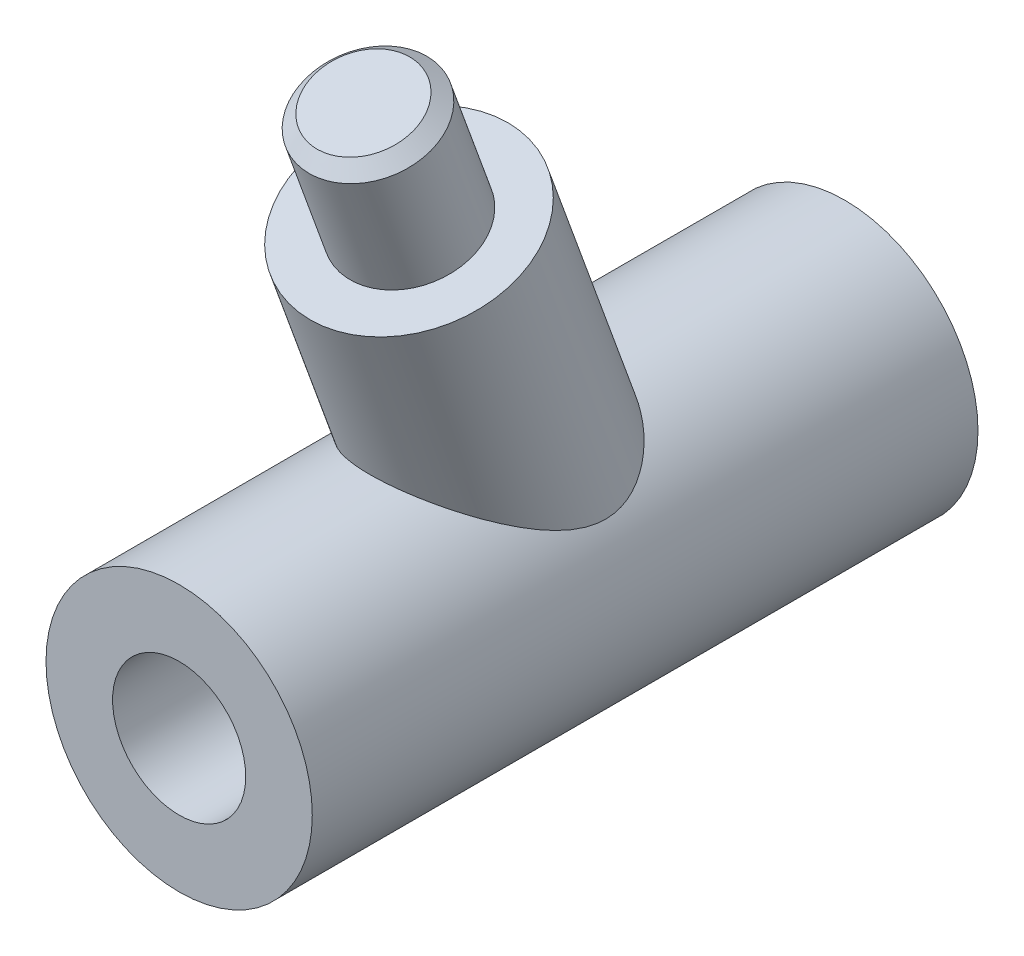
ISO-10303-21;
HEADER;
FILE_DESCRIPTION(('STEP AP214'),'2;1');
FILE_NAME('part.step','',(''),(''),'','','');
FILE_SCHEMA(('AUTOMOTIVE_DESIGN { 1 0 10303 214 1 1 1 1 }'));
ENDSEC;
DATA;
#1=APPLICATION_CONTEXT('core data for automotive mechanical design processes');
#2=APPLICATION_PROTOCOL_DEFINITION('international standard','automotive_design',2000,#1);
#3=PRODUCT_CONTEXT('',#1,'mechanical');
#4=PRODUCT('Part','Part','',(#3));
#5=PRODUCT_RELATED_PRODUCT_CATEGORY('part','',(#4));
#6=PRODUCT_DEFINITION_FORMATION('','',#4);
#7=PRODUCT_DEFINITION_CONTEXT('part definition',#1,'design');
#8=PRODUCT_DEFINITION('design','',#6,#7);
#9=PRODUCT_DEFINITION_SHAPE('','',#8);
#10=(LENGTH_UNIT() NAMED_UNIT(*) SI_UNIT(.MILLI.,.METRE.));
#11=(NAMED_UNIT(*) PLANE_ANGLE_UNIT() SI_UNIT($,.RADIAN.));
#12=(NAMED_UNIT(*) SI_UNIT($,.STERADIAN.) SOLID_ANGLE_UNIT());
#13=UNCERTAINTY_MEASURE_WITH_UNIT(LENGTH_MEASURE(1.E-05),#10,'distance_accuracy_value','');
#14=(GEOMETRIC_REPRESENTATION_CONTEXT(3) GLOBAL_UNCERTAINTY_ASSIGNED_CONTEXT((#13)) GLOBAL_UNIT_ASSIGNED_CONTEXT((#10,
#11,#12)) REPRESENTATION_CONTEXT('',''));
#15=CARTESIAN_POINT('',(0.,0.,0.));
#16=DIRECTION('',(0.,0.,1.));
#17=DIRECTION('',(1.,0.,0.));
#18=AXIS2_PLACEMENT_3D('',#15,#16,#17);
#19=CARTESIAN_POINT('',(0.,0.,50.));
#20=DIRECTION('',(0.,0.,-1.));
#21=DIRECTION('',(-1.,0.,0.));
#22=AXIS2_PLACEMENT_3D('',#19,#20,#21);
#23=CYLINDRICAL_SURFACE('',#22,10.);
#24=CARTESIAN_POINT('',(0.,0.,50.));
#25=DIRECTION('',(0.,0.,1.));
#26=DIRECTION('',(1.,0.,0.));
#27=AXIS2_PLACEMENT_3D('',#24,#25,#26);
#28=CIRCLE('',#27,10.);
#29=CARTESIAN_POINT('',(10.,0.,50.));
#30=VERTEX_POINT('',#29);
#31=EDGE_CURVE('E54',#30,#30,#28,.T.);
#32=ORIENTED_EDGE('',*,*,#31,.F.);
#33=EDGE_LOOP('',(#32));
#34=FACE_BOUND('',#33,.T.);
#35=CARTESIAN_POINT('',(0.,0.,0.));
#36=DIRECTION('',(0.,0.,1.));
#37=DIRECTION('',(1.,0.,0.));
#38=AXIS2_PLACEMENT_3D('',#35,#36,#37);
#39=CIRCLE('',#38,10.);
#40=CARTESIAN_POINT('',(10.,0.,0.));
#41=VERTEX_POINT('',#40);
#42=EDGE_CURVE('E55',#41,#41,#39,.T.);
#43=ORIENTED_EDGE('',*,*,#42,.T.);
#44=EDGE_LOOP('',(#43));
#45=FACE_BOUND('',#44,.T.);
#46=CARTESIAN_POINT('',(0.,10.,35.6864090878839));
#47=CARTESIAN_POINT('',(0.168759826717268,9.99999875421944,35.6864071390971));
#48=CARTESIAN_POINT('',(0.337540186331122,9.99571534603131,35.6790801913484));
#49=CARTESIAN_POINT('',(0.673429271317358,9.97871683016679,35.6499773659063));
#50=CARTESIAN_POINT('',(0.840537705424812,9.96600027845441,35.6281990136489));
#51=CARTESIAN_POINT('',(1.17166662149929,9.93251810287568,35.5707703917559));
#52=CARTESIAN_POINT('',(1.33568430974946,9.91174553177322,35.5351081490244));
#53=CARTESIAN_POINT('',(1.65926711268916,9.86273969532586,35.4507967501226));
#54=CARTESIAN_POINT('',(1.81882990671734,9.83450261885577,35.4021409597542));
#55=CARTESIAN_POINT('',(2.13082584689765,9.7716245379265,35.2934991203973));
#56=CARTESIAN_POINT('',(2.28331535629902,9.73705222806921,35.2336344732561));
#57=CARTESIAN_POINT('',(2.58227104254561,9.66207324249375,35.1033733080117));
#58=CARTESIAN_POINT('',(2.7287343577385,9.6216638350822,35.0329718582477));
#59=CARTESIAN_POINT('',(3.15830028848461,9.49286074866993,34.8076900269744));
#60=CARTESIAN_POINT('',(3.43182257981848,9.39684103181847,34.6386443834426));
#61=CARTESIAN_POINT('',(3.89426981710559,9.21315897798917,34.3116900121693));
#62=CARTESIAN_POINT('',(4.08854874311518,9.12832329638297,34.1595464177315));
#63=CARTESIAN_POINT('',(4.46124856337198,8.95207951944924,33.8401805017747));
#64=CARTESIAN_POINT('',(4.63966135801971,8.86066810982101,33.6729505654901));
#65=CARTESIAN_POINT('',(4.98163604504653,8.67303192188411,33.3253075815331));
#66=CARTESIAN_POINT('',(5.14514754074537,8.57679240066488,33.1448532687555));
#67=CARTESIAN_POINT('',(5.45738047466906,8.38158015350033,32.7730634766211));
#68=CARTESIAN_POINT('',(5.60610324832201,8.28260767537533,32.5817289822066));
#69=CARTESIAN_POINT('',(5.94390451266904,8.04533590512657,32.1141375656525));
#70=CARTESIAN_POINT('',(6.12655422925433,7.90652687007714,31.8334799076696));
#71=CARTESIAN_POINT('',(6.46639966562251,7.63108917113799,31.2559708880049));
#72=CARTESIAN_POINT('',(6.62357869507479,7.49446198939163,30.9591090770617));
#73=CARTESIAN_POINT('',(6.91287426563268,7.2284603292765,30.3508708600595));
#74=CARTESIAN_POINT('',(7.04503053269601,7.09907458847934,30.0395184551737));
#75=CARTESIAN_POINT('',(7.22432157465985,6.91495017024337,29.5617772822818));
#76=CARTESIAN_POINT('',(7.280914987281,6.85524953998169,29.4007908228604));
#77=CARTESIAN_POINT('',(7.38762263676795,6.74011746418009,29.0751965050798));
#78=CARTESIAN_POINT('',(7.43773803859008,6.68468525176718,28.9105893040951));
#79=CARTESIAN_POINT('',(7.53168991572059,6.57865623097756,28.5760327665592));
#80=CARTESIAN_POINT('',(7.57545603686061,6.52811540608183,28.4060457723594));
#81=CARTESIAN_POINT('',(7.65562457360982,6.4339131173203,28.0624946238159));
#82=CARTESIAN_POINT('',(7.6920290928939,6.39024968893844,27.8889315070627));
#83=CARTESIAN_POINT('',(7.75681859928311,6.31144724414092,27.5386737475704));
#84=CARTESIAN_POINT('',(7.78521625208069,6.27629477721856,27.3619845258514));
#85=CARTESIAN_POINT('',(7.83326715444001,6.21622202599869,27.0056772220141));
#86=CARTESIAN_POINT('',(7.85292197382103,6.19129990485371,26.8260596717009));
#87=CARTESIAN_POINT('',(7.87998708354155,6.15680078013761,26.4958253141776));
#88=CARTESIAN_POINT('',(7.8889219778084,6.14532169618626,26.3455342631491));
#89=CARTESIAN_POINT('',(7.89955763456892,6.13164501141249,26.0442869719184));
#90=CARTESIAN_POINT('',(7.90126044020698,6.12944478921107,25.8933309316488));
#91=CARTESIAN_POINT('',(7.8968777654343,6.135090637313,25.5918859402216));
#92=CARTESIAN_POINT('',(7.89080197156089,6.14292421273085,25.4413966416088));
#93=CARTESIAN_POINT('',(7.87041845049985,6.16901839709791,25.1418738430884));
#94=CARTESIAN_POINT('',(7.85611085561657,6.18727883846289,24.9928403198223));
#95=CARTESIAN_POINT('',(7.81891575650166,6.23421626869308,24.6970184365279));
#96=CARTESIAN_POINT('',(7.79600145445856,6.26292578300544,24.5502385949599));
#97=CARTESIAN_POINT('',(7.74151712673761,6.33014835968069,24.2605912534396));
#98=CARTESIAN_POINT('',(7.70994701835814,6.36866151571191,24.1177237908822));
#99=CARTESIAN_POINT('',(7.63821412461277,6.45451864803437,23.8366458800247));
#100=CARTESIAN_POINT('',(7.59803816366566,6.5018761506337,23.6984429529895));
#101=CARTESIAN_POINT('',(7.5093826199623,6.60407048750467,23.4275641988082));
#102=CARTESIAN_POINT('',(7.46090080787088,6.65890932900097,23.2948898674842));
#103=CARTESIAN_POINT('',(7.34214717537962,6.78988939092157,23.0012699179967));
#104=CARTESIAN_POINT('',(7.26950007614489,6.86783582615953,22.8420887641007));
#105=CARTESIAN_POINT('',(7.1122398176786,7.03056543539082,22.5334354350772));
#106=CARTESIAN_POINT('',(7.02762305972012,7.11535066218785,22.3839661996729));
#107=CARTESIAN_POINT('',(6.84702552341834,7.28930576256339,22.0944913848307));
#108=CARTESIAN_POINT('',(6.75103143156339,7.37848070013642,21.954497199786));
#109=CARTESIAN_POINT('',(6.54837788726454,7.5589123714027,21.6839373957007));
#110=CARTESIAN_POINT('',(6.44171911432236,7.65016897217687,21.5533711768675));
#111=CARTESIAN_POINT('',(6.21514846145864,7.83542818393242,21.2979010648342));
#112=CARTESIAN_POINT('',(6.09495064451129,7.92943662922722,21.1732553690342));
#113=CARTESIAN_POINT('',(5.84434716965742,8.11591059995631,20.9334462245162));
#114=CARTESIAN_POINT('',(5.71394153885302,8.20837612948629,20.8182827506241));
#115=CARTESIAN_POINT('',(5.44342147203671,8.39021569765755,20.5973549030536));
#116=CARTESIAN_POINT('',(5.30330864255279,8.47959024419914,20.4915889806751));
#117=CARTESIAN_POINT('',(5.01384650327767,8.65389479818482,20.2894470850873));
#118=CARTESIAN_POINT('',(4.86449686387894,8.73882464682387,20.1930714472784));
#119=CARTESIAN_POINT('',(4.52749615315887,8.91879647592465,19.9921835323946));
#120=CARTESIAN_POINT('',(4.33800355175961,9.01264120555651,19.8896719808733));
#121=CARTESIAN_POINT('',(3.94764244241388,9.19032752104317,19.6984956454274));
#122=CARTESIAN_POINT('',(3.74677257106234,9.27416790426243,19.6098325258459));
#123=CARTESIAN_POINT('',(3.33489252091246,9.43011020345129,19.4468261955555));
#124=CARTESIAN_POINT('',(3.12388210458398,9.50221184428116,19.3724833204858));
#125=CARTESIAN_POINT('',(2.6932093654705,9.63313364074987,19.2386523988533));
#126=CARTESIAN_POINT('',(2.47354793385084,9.69195516023021,19.1791628268199));
#127=CARTESIAN_POINT('',(2.04004397748889,9.79208082966772,19.0785104039531));
#128=CARTESIAN_POINT('',(1.82658626369448,9.83419393441823,19.036494528847));
#129=CARTESIAN_POINT('',(1.39513191582467,9.90461383029405,18.9664949849203));
#130=CARTESIAN_POINT('',(1.17713540514634,9.93292099625412,18.9385109351315));
#131=CARTESIAN_POINT('',(0.738506769971482,9.97512549444111,18.8968610085274));
#132=CARTESIAN_POINT('',(0.517876053612191,9.98903020491161,18.8831878003638));
#133=CARTESIAN_POINT('',(0.0757624678095885,10.002157686433,18.8702774393599));
#134=CARTESIAN_POINT('',(-0.145720348093114,10.0013813653573,18.8710393938507));
#135=CARTESIAN_POINT('',(-0.569364941561772,9.98583913360108,18.8863278574492));
#136=CARTESIAN_POINT('',(-0.771612463010394,9.97223328225625,18.8997129806084));
#137=CARTESIAN_POINT('',(-1.1737530685986,9.93293069469143,18.9385037791801));
#138=CARTESIAN_POINT('',(-1.37364630741163,9.90723475736849,18.9639086603433));
#139=CARTESIAN_POINT('',(-1.76969237361388,9.84420625181128,19.0265264868555));
#140=CARTESIAN_POINT('',(-1.96584543177106,9.80687440399048,19.0637387011802));
#141=CARTESIAN_POINT('',(-2.35315804055682,9.72121329056384,19.1496896044213));
#142=CARTESIAN_POINT('',(-2.5443174447432,9.67288370284472,19.1984286309485));
#143=CARTESIAN_POINT('',(-2.92206320582428,9.56558518800076,19.3075580669405));
#144=CARTESIAN_POINT('',(-3.1085981890296,9.50653096860588,19.368042172643));
#145=CARTESIAN_POINT('',(-3.47439702830418,9.37902366896198,19.5000455466425));
#146=CARTESIAN_POINT('',(-3.6536608853871,9.31057059002324,19.5715648134012));
#147=CARTESIAN_POINT('',(-4.00411119237793,9.16531983007489,19.7253413319072));
#148=CARTESIAN_POINT('',(-4.17529411545749,9.0885185530133,19.8076032142181));
#149=CARTESIAN_POINT('',(-4.50875289443422,8.92778871376216,19.9825652844379));
#150=CARTESIAN_POINT('',(-4.67102803594978,8.84385958130743,20.0752663077257));
#151=CARTESIAN_POINT('',(-4.99983081855791,8.66256027608942,20.2794885432887));
#152=CARTESIAN_POINT('',(-5.16548300003504,8.56465686319105,20.3919473272529));
#153=CARTESIAN_POINT('',(-5.48473684890454,8.36380488531226,20.6288684958471));
#154=CARTESIAN_POINT('',(-5.63833695258178,8.26085566846233,20.753332433449));
#155=CARTESIAN_POINT('',(-5.93282001321956,8.05197138495423,21.0143505899935));
#156=CARTESIAN_POINT('',(-6.07369872312142,7.94603533651266,21.1509088167173));
#157=CARTESIAN_POINT('',(-6.34194918458883,7.73362304765821,21.4362957809544));
#158=CARTESIAN_POINT('',(-6.46932382809657,7.62714692804212,21.5851218790767));
#159=CARTESIAN_POINT('',(-6.68579878184049,7.43750556627566,21.8644663466572));
#160=CARTESIAN_POINT('',(-6.77746662099948,7.35392552857709,21.9927181882131));
#161=CARTESIAN_POINT('',(-6.95116172256998,7.18996541603203,22.2575184940997));
#162=CARTESIAN_POINT('',(-7.03319099704885,7.10958467565161,22.3940652177985));
#163=CARTESIAN_POINT('',(-7.18694620083342,6.95411676090704,22.6753531103626));
#164=CARTESIAN_POINT('',(-7.2586899771391,6.87902053526221,22.8200794624424));
#165=CARTESIAN_POINT('',(-7.39143944552134,6.7361808183544,23.1178598826372));
#166=CARTESIAN_POINT('',(-7.45244767512152,6.66843559101688,23.2709119715997));
#167=CARTESIAN_POINT('',(-7.55297550330005,6.5541779212948,23.5560483544401));
#168=CARTESIAN_POINT('',(-7.59438382940312,6.50605100386696,23.6868207598808));
#169=CARTESIAN_POINT('',(-7.66939022804063,6.41746250997462,23.9531044134209));
#170=CARTESIAN_POINT('',(-7.70299011142704,6.37699915666042,24.0886145543912));
#171=CARTESIAN_POINT('',(-7.76219638414383,6.30479908516989,24.3635146175197));
#172=CARTESIAN_POINT('',(-7.78781028086546,6.27305417440764,24.5029007608522));
#173=CARTESIAN_POINT('',(-7.83107965478815,6.21895435900616,24.7847014137132));
#174=CARTESIAN_POINT('',(-7.8487350052263,6.19659960393275,24.9271159714402));
#175=CARTESIAN_POINT('',(-7.87624051194658,6.16160192241589,25.2137042449269));
#176=CARTESIAN_POINT('',(-7.88609987678023,6.1489475385186,25.3578756803718));
#177=CARTESIAN_POINT('',(-7.89839003626523,6.13314830033174,25.647014463668));
#178=CARTESIAN_POINT('',(-7.90082077994539,6.13000351129187,25.7919818169736));
#179=CARTESIAN_POINT('',(-7.89763630116207,6.13412870507261,26.2269449846954));
#180=CARTESIAN_POINT('',(-7.88153004335717,6.1549767883485,26.5168409358002));
#181=CARTESIAN_POINT('',(-7.83144421752635,6.21848756855762,27.0293835682188));
#182=CARTESIAN_POINT('',(-7.8019691110961,6.25559919328007,27.2532772701395));
#183=CARTESIAN_POINT('',(-7.72997973833747,6.34434386107111,27.6961483661867));
#184=CARTESIAN_POINT('',(-7.68745736850922,6.39598592716477,27.9151226139328));
#185=CARTESIAN_POINT('',(-7.5905338567081,6.51071713991951,28.3482082059446));
#186=CARTESIAN_POINT('',(-7.53608860973118,6.57384863767645,28.5622981462754));
#187=CARTESIAN_POINT('',(-7.41633473220055,6.70866001881199,28.9845899232805));
#188=CARTESIAN_POINT('',(-7.35102711417247,6.78033910525912,29.1927923066435));
#189=CARTESIAN_POINT('',(-7.16944570960004,6.97318219005577,29.7218029398887));
#190=CARTESIAN_POINT('',(-7.04550354248902,7.09903997779947,30.0382875324786));
#191=CARTESIAN_POINT('',(-6.77275450866556,7.35972015384047,30.6566763773514));
#192=CARTESIAN_POINT('',(-6.62393144563492,7.49454834681498,30.9585709661214));
#193=CARTESIAN_POINT('',(-6.30129409607894,7.76777600770264,31.5463402677351));
#194=CARTESIAN_POINT('',(-6.12751751014643,7.90616983426373,31.8322382591711));
#195=CARTESIAN_POINT('',(-5.75369401795444,8.18223632189856,32.3865132604253));
#196=CARTESIAN_POINT('',(-5.55366600989937,8.31990942836982,32.6549026684199));
#197=CARTESIAN_POINT('',(-5.2060761294037,8.53942100177106,33.0740244472533));
#198=CARTESIAN_POINT('',(-5.06705110091291,8.62279694653861,33.2310649720752));
#199=CARTESIAN_POINT('',(-4.77757955784289,8.78648928802169,33.5360433648831));
#200=CARTESIAN_POINT('',(-4.62713174073933,8.86680533424846,33.6839801912945));
#201=CARTESIAN_POINT('',(-4.31463079861706,9.02299295532508,33.9690934647034));
#202=CARTESIAN_POINT('',(-4.15259642906238,9.09887136702655,34.1062865808493));
#203=CARTESIAN_POINT('',(-3.81651466707181,9.24488147468791,34.368346428295));
#204=CARTESIAN_POINT('',(-3.64246956175052,9.31501425921198,34.4932154954261));
#205=CARTESIAN_POINT('',(-3.18683646918618,9.48314234233689,34.7907918528153));
#206=CARTESIAN_POINT('',(-2.89694909764727,9.5763200207364,34.9539878240861));
#207=CARTESIAN_POINT('',(-2.44267888050194,9.69834836638095,35.1664725457355));
#208=CARTESIAN_POINT('',(-2.28804954080809,9.73606216348595,35.231905738085));
#209=CARTESIAN_POINT('',(-1.97279308915188,9.80479810675246,35.3508703851355));
#210=CARTESIAN_POINT('',(-1.81216712167467,9.8358215222234,35.4044040974832));
#211=CARTESIAN_POINT('',(-1.51629207018075,9.88529154920519,35.4896168092495));
#212=CARTESIAN_POINT('',(-1.38188776342846,9.90500439524869,35.5235091734013));
#213=CARTESIAN_POINT('',(-1.11042485688468,9.93909744400342,35.5820632421081));
#214=CARTESIAN_POINT('',(-0.973366722030315,9.95347857206723,35.6067265484301));
#215=CARTESIAN_POINT('',(-0.697383035612736,9.97661413349472,35.6463784147372));
#216=CARTESIAN_POINT('',(-0.558457516524774,9.98536866458032,35.6613671427489));
#217=CARTESIAN_POINT('',(-0.279692505115788,9.99706123119971,35.6813817746523));
#218=CARTESIAN_POINT('',(-0.139853303181641,10.0000010323934,35.6864107028671));
#219=CARTESIAN_POINT('',(0.,10.,35.6864090878839));
#220=B_SPLINE_CURVE_WITH_KNOTS('',3,(#46,#47,#48,#49,#50,#51,#52,#53,#54,#55,#56,#57,#58,#59,
#60,#61,#62,#63,#64,#65,#66,#67,#68,#69,#70,#71,#72,#73,#74,#75,#76,#77,#78,#79,#80,#81,#82,#83,
#84,#85,#86,#87,#88,#89,#90,#91,#92,#93,#94,#95,#96,#97,#98,#99,#100,#101,#102,#103,#104,#105,
#106,#107,#108,#109,#110,#111,#112,#113,#114,#115,#116,#117,#118,#119,#120,#121,#122,#123,#124,
#125,#126,#127,#128,#129,#130,#131,#132,#133,#134,#135,#136,#137,#138,#139,#140,#141,#142,#143,
#144,#145,#146,#147,#148,#149,#150,#151,#152,#153,#154,#155,#156,#157,#158,#159,#160,#161,#162,
#163,#164,#165,#166,#167,#168,#169,#170,#171,#172,#173,#174,#175,#176,#177,#178,#179,#180,#181,
#182,#183,#184,#185,#186,#187,#188,#189,#190,#191,#192,#193,#194,#195,#196,#197,#198,#199,#200,
#201,#202,#203,#204,#205,#206,#207,#208,#209,#210,#211,#212,#213,#214,#215,#216,#217,#218,#219),
.UNSPECIFIED.,.T.,.F.,(4,2,2,2,2,2,2,2,2,2,2,2,2,2,2,2,2,2,2,2,2,2,2,2,2,2,2,2,2,2,2,2,2,2,2,2,
2,2,2,2,2,2,2,2,2,2,2,2,2,2,2,2,2,2,2,2,2,2,2,2,2,2,2,2,2,2,2,2,2,2,2,2,2,2,2,2,2,2,2,2,2,2,2,2,
2,2,4),(0.,0.506105103102447,1.0122968906967,1.51892617496527,2.02581462836387,2.52750111049151,
3.02942314128756,4.03248343531026,4.8143407521611,5.59659494003323,6.38140350841825,
7.16614114376605,8.252168135055,9.33890392099652,10.4238996750031,10.9660975799604,
11.5081978441036,12.0559087564606,12.6034629313249,13.1501460329286,13.6967309351961,
14.14930192755,14.6017450551248,15.053625311792,15.5054983058859,15.9587900727795,
16.4120861707857,16.866081290837,17.3201984570825,17.893998074661,18.4679705755649,
19.0426214841843,19.6172358021396,20.2078189702717,20.7984005704367,21.3888846625719,
21.9793898377893,22.6834797427365,23.3876542021649,24.0918451640849,24.795963774093,
25.4598449139486,26.123708028259,26.7872308832323,27.4507127061563,28.0594274661521,
28.668102008722,29.2767388739429,29.8853935678497,30.4991195999961,31.1128455465845,
31.7268369160273,32.3408774543051,33.0087769218076,33.6767629041362,34.3449710765295,
35.0130358595573,35.5478932491479,36.0826387872068,36.6164449241403,37.1501247172072,
37.5857853317943,38.0213448115023,38.456493591301,38.8916493018599,39.3262902391708,
39.7609341587461,40.6307042927396,41.3163846177536,42.0024916756532,42.6911809882272,
43.3798061412196,44.4656635007743,45.5522304755,46.6371727724321,47.7213382683763,
48.3980241494863,49.0747873083455,49.7504787446726,50.4260418672932,51.4579676236671,
51.9737176063146,52.4893696538358,52.9089926191725,53.3285427222208,53.7480855383852,
54.1675009395668),.UNSPECIFIED.);
#221=CARTESIAN_POINT('',(0.,10.,35.6864090878839));
#222=VERTEX_POINT('',#221);
#223=EDGE_CURVE('E46',#222,#222,#220,.T.);
#224=ORIENTED_EDGE('',*,*,#223,.F.);
#225=EDGE_LOOP('',(#224));
#226=FACE_BOUND('',#225,.T.);
#227=ADVANCED_FACE('F31',(#34,#45,#226),#23,.T.);
#228=CARTESIAN_POINT('',(0.,0.,50.));
#229=DIRECTION('',(0.,0.,1.));
#230=DIRECTION('',(1.,0.,0.));
#231=AXIS2_PLACEMENT_3D('',#228,#229,#230);
#232=PLANE('',#231);
#233=ORIENTED_EDGE('',*,*,#31,.T.);
#234=EDGE_LOOP('',(#233));
#235=FACE_BOUND('',#234,.T.);
#236=CARTESIAN_POINT('',(0.,0.,50.));
#237=DIRECTION('',(0.,0.,1.));
#238=DIRECTION('',(1.,0.,0.));
#239=AXIS2_PLACEMENT_3D('',#236,#237,#238);
#240=CIRCLE('',#239,5.);
#241=CARTESIAN_POINT('',(5.,0.,50.));
#242=VERTEX_POINT('',#241);
#243=EDGE_CURVE('E93',#242,#242,#240,.T.);
#244=ORIENTED_EDGE('',*,*,#243,.F.);
#245=EDGE_LOOP('',(#244));
#246=FACE_BOUND('',#245,.T.);
#247=ADVANCED_FACE('F73',(#235,#246),#232,.T.);
#248=CARTESIAN_POINT('',(0.,0.,0.));
#249=DIRECTION('',(0.,0.,1.));
#250=DIRECTION('',(1.,0.,0.));
#251=AXIS2_PLACEMENT_3D('',#248,#249,#250);
#252=PLANE('',#251);
#253=ORIENTED_EDGE('',*,*,#42,.F.);
#254=EDGE_LOOP('',(#253));
#255=FACE_BOUND('',#254,.T.);
#256=CARTESIAN_POINT('',(0.,0.,0.));
#257=DIRECTION('',(0.,0.,1.));
#258=DIRECTION('',(1.,0.,0.));
#259=AXIS2_PLACEMENT_3D('',#256,#257,#258);
#260=CIRCLE('',#259,5.);
#261=CARTESIAN_POINT('',(5.,0.,0.));
#262=VERTEX_POINT('',#261);
#263=EDGE_CURVE('E95',#262,#262,#260,.T.);
#264=ORIENTED_EDGE('',*,*,#263,.T.);
#265=EDGE_LOOP('',(#264));
#266=FACE_BOUND('',#265,.T.);
#267=ADVANCED_FACE('F71',(#255,#266),#252,.F.);
#268=CARTESIAN_POINT('',(0.,0.,50.));
#269=DIRECTION('',(0.,0.,-1.));
#270=DIRECTION('',(-1.,0.,0.));
#271=AXIS2_PLACEMENT_3D('',#268,#269,#270);
#272=CYLINDRICAL_SURFACE('',#271,5.);
#273=ORIENTED_EDGE('',*,*,#243,.T.);
#274=EDGE_LOOP('',(#273));
#275=FACE_BOUND('',#274,.T.);
#276=ORIENTED_EDGE('',*,*,#263,.F.);
#277=EDGE_LOOP('',(#276));
#278=FACE_BOUND('',#277,.T.);
#279=ADVANCED_FACE('F68',(#275,#278),#272,.F.);
#280=CARTESIAN_POINT('',(0.,25.,32.7389581993173));
#281=DIRECTION('',(0.,-0.939692620785907,-0.342020143325674));
#282=DIRECTION('',(0.,0.342020143325674,-0.939692620785907));
#283=AXIS2_PLACEMENT_3D('',#280,#281,#282);
#284=PLANE('',#283);
#285=CARTESIAN_POINT('',(0.,25.,32.7389581993173));
#286=DIRECTION('',(0.,-0.939692620785907,-0.342020143325674));
#287=DIRECTION('',(0.,0.342020143325674,-0.939692620785907));
#288=AXIS2_PLACEMENT_3D('',#285,#286,#287);
#289=CIRCLE('',#288,4.7);
#290=CARTESIAN_POINT('',(0.,26.6074946736307,28.3224028816235));
#291=VERTEX_POINT('',#290);
#292=EDGE_CURVE('E42',#291,#291,#289,.F.);
#293=ORIENTED_EDGE('',*,*,#292,.F.);
#294=EDGE_LOOP('',(#293));
#295=FACE_BOUND('',#294,.T.);
#296=CARTESIAN_POINT('',(0.,25.,32.7389581993173));
#297=DIRECTION('',(0.,-0.939692620785907,-0.342020143325674));
#298=DIRECTION('',(0.,0.342020143325674,-0.939692620785907));
#299=AXIS2_PLACEMENT_3D('',#296,#297,#298);
#300=CIRCLE('',#299,7.9);
#301=CARTESIAN_POINT('',(0.,27.7019591322728,25.3153864951086));
#302=VERTEX_POINT('',#301);
#303=EDGE_CURVE('E99',#302,#302,#300,.T.);
#304=ORIENTED_EDGE('',*,*,#303,.F.);
#305=EDGE_LOOP('',(#304));
#306=FACE_BOUND('',#305,.T.);
#307=ADVANCED_FACE('F65',(#295,#306),#284,.F.);
#308=CARTESIAN_POINT('',(0.,-16.4290805128919,17.6600060596064));
#309=DIRECTION('',(0.,0.939692620785907,0.342020143325674));
#310=DIRECTION('',(0.,-0.342020143325674,0.939692620785907));
#311=AXIS2_PLACEMENT_3D('',#308,#309,#310);
#312=CYLINDRICAL_SURFACE('',#311,7.9);
#313=ORIENTED_EDGE('',*,*,#303,.T.);
#314=EDGE_LOOP('',(#313));
#315=FACE_BOUND('',#314,.T.);
#316=ORIENTED_EDGE('',*,*,#223,.T.);
#317=EDGE_LOOP('',(#316));
#318=FACE_BOUND('',#317,.T.);
#319=ADVANCED_FACE('F59',(#315,#318),#312,.T.);
#320=CARTESIAN_POINT('',(0.,34.3969262078591,36.1591596325741));
#321=DIRECTION('',(0.,-0.939692620785907,-0.342020143325674));
#322=DIRECTION('',(0.,0.342020143325674,-0.939692620785907));
#323=AXIS2_PLACEMENT_3D('',#320,#321,#322);
#324=CYLINDRICAL_SURFACE('',#323,4.7);
#325=CARTESIAN_POINT('',(0.,33.4572335870732,35.8171394892484));
#326=DIRECTION('',(0.,0.939692620785906,0.342020143325675));
#327=DIRECTION('',(0.,-0.342020143325675,0.939692620785906));
#328=AXIS2_PLACEMENT_3D('',#325,#326,#327);
#329=CIRCLE('',#328,4.7);
#330=CARTESIAN_POINT('',(0.,31.8497389134425,40.2336948069421));
#331=VERTEX_POINT('',#330);
#332=EDGE_CURVE('E10',#331,#331,#329,.F.);
#333=ORIENTED_EDGE('',*,*,#332,.T.);
#334=EDGE_LOOP('',(#333));
#335=FACE_BOUND('',#334,.T.);
#336=ORIENTED_EDGE('',*,*,#292,.T.);
#337=EDGE_LOOP('',(#336));
#338=FACE_BOUND('',#337,.T.);
#339=ADVANCED_FACE('F64',(#335,#338),#324,.T.);
#340=CARTESIAN_POINT('',(0.,34.3969262078591,36.1591596325741));
#341=DIRECTION('',(0.,0.939692620785907,0.342020143325674));
#342=DIRECTION('',(0.,-0.342020143325674,0.939692620785907));
#343=AXIS2_PLACEMENT_3D('',#340,#341,#342);
#344=PLANE('',#343);
#345=CARTESIAN_POINT('',(0.,34.3969262078591,36.1591596325741));
#346=DIRECTION('',(0.,0.939692620785907,0.342020143325674));
#347=DIRECTION('',(0.,-0.342020143325674,0.939692620785907));
#348=AXIS2_PLACEMENT_3D('',#345,#346,#347);
#349=CIRCLE('',#348,3.69999999999998);
#350=CARTESIAN_POINT('',(0.,33.1314516775541,39.6360223294819));
#351=VERTEX_POINT('',#350);
#352=EDGE_CURVE('E38',#351,#351,#349,.T.);
#353=ORIENTED_EDGE('',*,*,#352,.T.);
#354=EDGE_LOOP('',(#353));
#355=FACE_BOUND('',#354,.T.);
#356=ADVANCED_FACE('F112',(#355),#344,.T.);
#357=CARTESIAN_POINT('',(0.,34.3969262078591,36.1591596325741));
#358=DIRECTION('',(0.,-0.939692620785906,-0.342020143325675));
#359=DIRECTION('',(0.,0.342020143325675,-0.939692620785906));
#360=AXIS2_PLACEMENT_3D('',#357,#358,#359);
#361=CONICAL_SURFACE('',#360,3.69999999999999,0.785398163397444);
#362=ORIENTED_EDGE('',*,*,#332,.F.);
#363=EDGE_LOOP('',(#362));
#364=FACE_BOUND('',#363,.T.);
#365=ORIENTED_EDGE('',*,*,#352,.F.);
#366=EDGE_LOOP('',(#365));
#367=FACE_BOUND('',#366,.T.);
#368=ADVANCED_FACE('F33',(#364,#367),#361,.T.);
#369=CLOSED_SHELL('',(#227,#247,#267,#279,#307,#319,#339,#356,#368));
#370=MANIFOLD_SOLID_BREP('B2',#369);
#371=ADVANCED_BREP_SHAPE_REPRESENTATION('',(#18,#370),#14);
#372=SHAPE_DEFINITION_REPRESENTATION(#9,#371);
ENDSEC;
END-ISO-10303-21;
